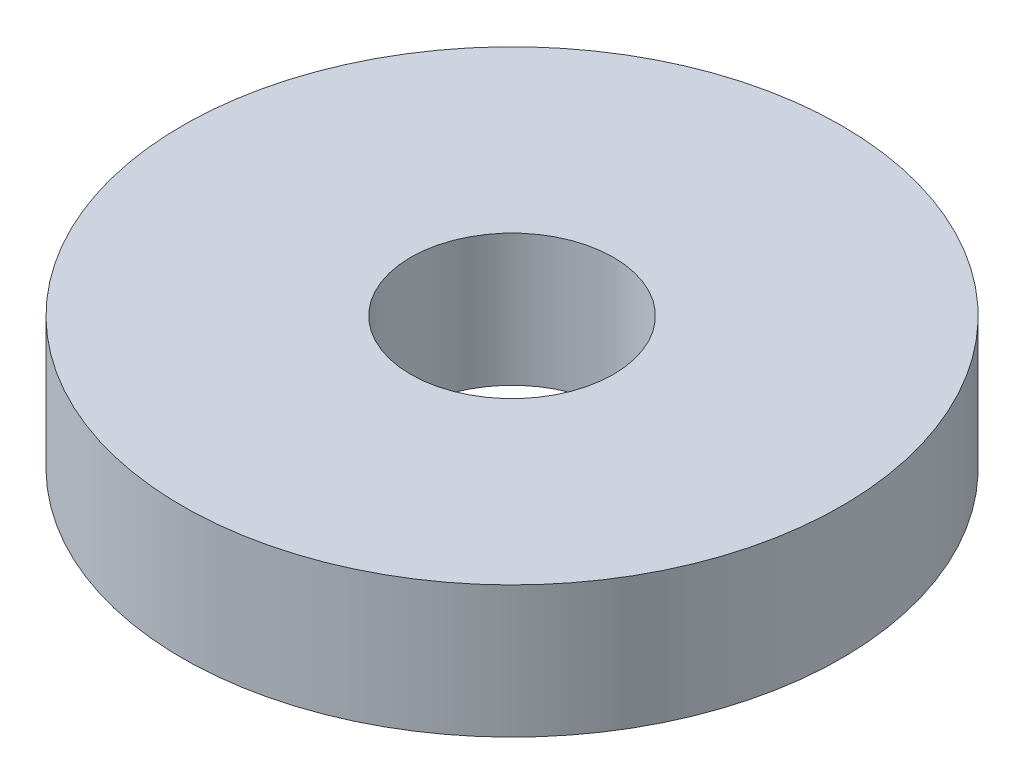
ISO-10303-21;
HEADER;
FILE_DESCRIPTION(('STEP AP214'),'2;1');
FILE_NAME('part.step','',(''),(''),'','','');
FILE_SCHEMA(('AUTOMOTIVE_DESIGN { 1 0 10303 214 1 1 1 1 }'));
ENDSEC;
DATA;
#1=APPLICATION_CONTEXT('core data for automotive mechanical design processes');
#2=APPLICATION_PROTOCOL_DEFINITION('international standard','automotive_design',2000,#1);
#3=PRODUCT_CONTEXT('',#1,'mechanical');
#4=PRODUCT('Part','Part','',(#3));
#5=PRODUCT_RELATED_PRODUCT_CATEGORY('part','',(#4));
#6=PRODUCT_DEFINITION_FORMATION('','',#4);
#7=PRODUCT_DEFINITION_CONTEXT('part definition',#1,'design');
#8=PRODUCT_DEFINITION('design','',#6,#7);
#9=PRODUCT_DEFINITION_SHAPE('','',#8);
#10=(LENGTH_UNIT() NAMED_UNIT(*) SI_UNIT(.MILLI.,.METRE.));
#11=(NAMED_UNIT(*) PLANE_ANGLE_UNIT() SI_UNIT($,.RADIAN.));
#12=(NAMED_UNIT(*) SI_UNIT($,.STERADIAN.) SOLID_ANGLE_UNIT());
#13=UNCERTAINTY_MEASURE_WITH_UNIT(LENGTH_MEASURE(1.E-05),#10,'distance_accuracy_value','');
#14=(GEOMETRIC_REPRESENTATION_CONTEXT(3) GLOBAL_UNCERTAINTY_ASSIGNED_CONTEXT((#13)) GLOBAL_UNIT_ASSIGNED_CONTEXT((#10,
#11,#12)) REPRESENTATION_CONTEXT('',''));
#15=CARTESIAN_POINT('',(0.,0.,0.));
#16=DIRECTION('',(0.,0.,1.));
#17=DIRECTION('',(1.,0.,0.));
#18=AXIS2_PLACEMENT_3D('',#15,#16,#17);
#19=CARTESIAN_POINT('',(0.,26.,0.));
#20=DIRECTION('',(0.,-1.,0.));
#21=DIRECTION('',(0.,0.,-1.));
#22=AXIS2_PLACEMENT_3D('',#19,#20,#21);
#23=CYLINDRICAL_SURFACE('',#22,65.);
#24=CARTESIAN_POINT('',(0.,26.,0.));
#25=DIRECTION('',(0.,1.,0.));
#26=DIRECTION('',(0.,0.,1.));
#27=AXIS2_PLACEMENT_3D('',#24,#25,#26);
#28=CIRCLE('',#27,65.);
#29=CARTESIAN_POINT('',(0.,26.,-65.));
#30=VERTEX_POINT('',#29);
#31=EDGE_CURVE('E10',#30,#30,#28,.T.);
#32=CARTESIAN_POINT('',(0.,0.,0.));
#33=DIRECTION('',(0.,1.,0.));
#34=DIRECTION('',(0.,0.,1.));
#35=AXIS2_PLACEMENT_3D('',#32,#33,#34);
#36=CIRCLE('',#35,65.);
#37=CARTESIAN_POINT('',(0.,0.,-65.));
#38=VERTEX_POINT('',#37);
#39=EDGE_CURVE('E37',#38,#38,#36,.T.);
#40=CARTESIAN_POINT('',(0.,26.,-65.));
#41=CARTESIAN_POINT('',(0.,25.7291666666667,-65.));
#42=CARTESIAN_POINT('',(0.,25.4583333333333,-65.));
#43=CARTESIAN_POINT('',(0.,24.9166666666667,-65.));
#44=CARTESIAN_POINT('',(0.,24.6458333333333,-65.));
#45=CARTESIAN_POINT('',(0.,24.1041666666667,-65.));
#46=CARTESIAN_POINT('',(0.,23.8333333333333,-65.));
#47=CARTESIAN_POINT('',(0.,23.2916666666667,-65.));
#48=CARTESIAN_POINT('',(0.,23.0208333333333,-65.));
#49=CARTESIAN_POINT('',(0.,22.4791666666667,-65.));
#50=CARTESIAN_POINT('',(0.,22.2083333333333,-65.));
#51=CARTESIAN_POINT('',(0.,21.6666666666667,-65.));
#52=CARTESIAN_POINT('',(0.,21.3958333333333,-65.));
#53=CARTESIAN_POINT('',(0.,20.8541666666667,-65.));
#54=CARTESIAN_POINT('',(0.,20.5833333333333,-65.));
#55=CARTESIAN_POINT('',(0.,20.0416666666667,-65.));
#56=CARTESIAN_POINT('',(0.,19.7708333333333,-65.));
#57=CARTESIAN_POINT('',(0.,19.2291666666667,-65.));
#58=CARTESIAN_POINT('',(0.,18.9583333333333,-65.));
#59=CARTESIAN_POINT('',(0.,18.4166666666667,-65.));
#60=CARTESIAN_POINT('',(0.,18.1458333333333,-65.));
#61=CARTESIAN_POINT('',(0.,17.6041666666667,-65.));
#62=CARTESIAN_POINT('',(0.,17.3333333333333,-65.));
#63=CARTESIAN_POINT('',(0.,16.7916666666667,-65.));
#64=CARTESIAN_POINT('',(0.,16.5208333333333,-65.));
#65=CARTESIAN_POINT('',(0.,15.9791666666667,-65.));
#66=CARTESIAN_POINT('',(0.,15.7083333333333,-65.));
#67=CARTESIAN_POINT('',(0.,15.1666666666667,-65.));
#68=CARTESIAN_POINT('',(0.,14.8958333333333,-65.));
#69=CARTESIAN_POINT('',(0.,14.3541666666667,-65.));
#70=CARTESIAN_POINT('',(0.,14.0833333333333,-65.));
#71=CARTESIAN_POINT('',(0.,13.5416666666667,-65.));
#72=CARTESIAN_POINT('',(0.,13.2708333333333,-65.));
#73=CARTESIAN_POINT('',(0.,12.7291666666667,-65.));
#74=CARTESIAN_POINT('',(0.,12.4583333333333,-65.));
#75=CARTESIAN_POINT('',(0.,11.9166666666667,-65.));
#76=CARTESIAN_POINT('',(0.,11.6458333333333,-65.));
#77=CARTESIAN_POINT('',(0.,11.1041666666667,-65.));
#78=CARTESIAN_POINT('',(0.,10.8333333333333,-65.));
#79=CARTESIAN_POINT('',(0.,10.2916666666667,-65.));
#80=CARTESIAN_POINT('',(0.,10.0208333333333,-65.));
#81=CARTESIAN_POINT('',(0.,9.47916666666667,-65.));
#82=CARTESIAN_POINT('',(0.,9.20833333333333,-65.));
#83=CARTESIAN_POINT('',(0.,8.66666666666667,-65.));
#84=CARTESIAN_POINT('',(0.,8.39583333333333,-65.));
#85=CARTESIAN_POINT('',(0.,7.85416666666667,-65.));
#86=CARTESIAN_POINT('',(0.,7.58333333333333,-65.));
#87=CARTESIAN_POINT('',(0.,7.04166666666667,-65.));
#88=CARTESIAN_POINT('',(0.,6.77083333333333,-65.));
#89=CARTESIAN_POINT('',(0.,6.22916666666667,-65.));
#90=CARTESIAN_POINT('',(0.,5.95833333333333,-65.));
#91=CARTESIAN_POINT('',(0.,5.41666666666667,-65.));
#92=CARTESIAN_POINT('',(0.,5.14583333333333,-65.));
#93=CARTESIAN_POINT('',(0.,4.60416666666667,-65.));
#94=CARTESIAN_POINT('',(0.,4.33333333333333,-65.));
#95=CARTESIAN_POINT('',(0.,3.79166666666667,-65.));
#96=CARTESIAN_POINT('',(0.,3.52083333333333,-65.));
#97=CARTESIAN_POINT('',(0.,2.97916666666667,-65.));
#98=CARTESIAN_POINT('',(0.,2.70833333333333,-65.));
#99=CARTESIAN_POINT('',(0.,2.16666666666667,-65.));
#100=CARTESIAN_POINT('',(0.,1.89583333333333,-65.));
#101=CARTESIAN_POINT('',(0.,1.35416666666667,-65.));
#102=CARTESIAN_POINT('',(0.,1.08333333333333,-65.));
#103=CARTESIAN_POINT('',(0.,0.541666666666667,-65.));
#104=CARTESIAN_POINT('',(0.,0.270833333333334,-65.));
#105=CARTESIAN_POINT('',(0.,0.,-65.));
#106=B_SPLINE_CURVE_WITH_KNOTS('',3,(#40,#41,#42,#43,#44,#45,#46,#47,#48,#49,#50,#51,#52,#53,
#54,#55,#56,#57,#58,#59,#60,#61,#62,#63,#64,#65,#66,#67,#68,#69,#70,#71,#72,#73,#74,#75,#76,#77,
#78,#79,#80,#81,#82,#83,#84,#85,#86,#87,#88,#89,#90,#91,#92,#93,#94,#95,#96,#97,#98,#99,#100,
#101,#102,#103,#104,#105),.UNSPECIFIED.,.F.,.F.,(4,2,2,2,2,2,2,2,2,2,2,2,2,2,2,2,2,2,2,2,2,2,2,
2,2,2,2,2,2,2,2,2,4),(0.,0.812499999999997,1.625,2.4375,3.25,4.0625,4.875,5.6875,6.5,7.3125,
8.125,8.93749999999999,9.74999999999999,10.5625,11.375,12.1875,13.,13.8125,14.625,15.4375,16.25,
17.0625,17.875,18.6875,19.5,20.3125,21.125,21.9375,22.75,23.5625,24.375,25.1875,26.),.UNSPECIFIED.);
#107=EDGE_CURVE('BSEAM40',#30,#38,#106,.T.);
#108=ORIENTED_EDGE('',*,*,#31,.F.);
#109=ORIENTED_EDGE('',*,*,#39,.T.);
#110=ORIENTED_EDGE('',*,*,#107,.T.);
#111=ORIENTED_EDGE('',*,*,#107,.F.);
#112=EDGE_LOOP('',(#108,#110,#109,#111));
#113=FACE_BOUND('',#112,.T.);
#114=ADVANCED_FACE('F40',(#113),#23,.T.);
#115=CARTESIAN_POINT('',(0.,26.,0.));
#116=DIRECTION('',(0.,1.,0.));
#117=DIRECTION('',(0.,0.,1.));
#118=AXIS2_PLACEMENT_3D('',#115,#116,#117);
#119=PLANE('',#118);
#120=CARTESIAN_POINT('',(0.,26.,0.));
#121=DIRECTION('',(0.,1.,0.));
#122=DIRECTION('',(0.,0.,1.));
#123=AXIS2_PLACEMENT_3D('',#120,#121,#122);
#124=CIRCLE('',#123,20.);
#125=CARTESIAN_POINT('',(0.,26.,-20.));
#126=VERTEX_POINT('',#125);
#127=EDGE_CURVE('E50',#126,#126,#124,.T.);
#128=ORIENTED_EDGE('',*,*,#127,.F.);
#129=EDGE_LOOP('',(#128));
#130=FACE_BOUND('',#129,.T.);
#131=ORIENTED_EDGE('',*,*,#31,.T.);
#132=EDGE_LOOP('',(#131));
#133=FACE_BOUND('',#132,.T.);
#134=ADVANCED_FACE('F59',(#130,#133),#119,.T.);
#135=CARTESIAN_POINT('',(0.,0.,0.));
#136=DIRECTION('',(0.,1.,0.));
#137=DIRECTION('',(0.,0.,1.));
#138=AXIS2_PLACEMENT_3D('',#135,#136,#137);
#139=PLANE('',#138);
#140=CARTESIAN_POINT('',(0.,0.,0.));
#141=DIRECTION('',(0.,1.,0.));
#142=DIRECTION('',(0.,0.,1.));
#143=AXIS2_PLACEMENT_3D('',#140,#141,#142);
#144=CIRCLE('',#143,20.);
#145=CARTESIAN_POINT('',(0.,0.,-20.));
#146=VERTEX_POINT('',#145);
#147=EDGE_CURVE('E47',#146,#146,#144,.T.);
#148=ORIENTED_EDGE('',*,*,#147,.T.);
#149=EDGE_LOOP('',(#148));
#150=FACE_BOUND('',#149,.T.);
#151=ORIENTED_EDGE('',*,*,#39,.F.);
#152=EDGE_LOOP('',(#151));
#153=FACE_BOUND('',#152,.T.);
#154=ADVANCED_FACE('F58',(#150,#153),#139,.F.);
#155=CARTESIAN_POINT('',(0.,26.,0.));
#156=DIRECTION('',(0.,-1.,0.));
#157=DIRECTION('',(0.,0.,-1.));
#158=AXIS2_PLACEMENT_3D('',#155,#156,#157);
#159=CYLINDRICAL_SURFACE('',#158,20.);
#160=CARTESIAN_POINT('',(0.,26.,-20.));
#161=CARTESIAN_POINT('',(0.,25.7291666666667,-20.));
#162=CARTESIAN_POINT('',(0.,25.4583333333333,-20.));
#163=CARTESIAN_POINT('',(0.,24.9166666666667,-20.));
#164=CARTESIAN_POINT('',(0.,24.6458333333333,-20.));
#165=CARTESIAN_POINT('',(0.,24.1041666666667,-20.));
#166=CARTESIAN_POINT('',(0.,23.8333333333333,-20.));
#167=CARTESIAN_POINT('',(0.,23.2916666666667,-20.));
#168=CARTESIAN_POINT('',(0.,23.0208333333333,-20.));
#169=CARTESIAN_POINT('',(0.,22.4791666666667,-20.));
#170=CARTESIAN_POINT('',(0.,22.2083333333333,-20.));
#171=CARTESIAN_POINT('',(0.,21.6666666666667,-20.));
#172=CARTESIAN_POINT('',(0.,21.3958333333333,-20.));
#173=CARTESIAN_POINT('',(0.,20.8541666666667,-20.));
#174=CARTESIAN_POINT('',(0.,20.5833333333333,-20.));
#175=CARTESIAN_POINT('',(0.,20.0416666666667,-20.));
#176=CARTESIAN_POINT('',(0.,19.7708333333333,-20.));
#177=CARTESIAN_POINT('',(0.,19.2291666666667,-20.));
#178=CARTESIAN_POINT('',(0.,18.9583333333333,-20.));
#179=CARTESIAN_POINT('',(0.,18.4166666666667,-20.));
#180=CARTESIAN_POINT('',(0.,18.1458333333333,-20.));
#181=CARTESIAN_POINT('',(0.,17.6041666666667,-20.));
#182=CARTESIAN_POINT('',(0.,17.3333333333333,-20.));
#183=CARTESIAN_POINT('',(0.,16.7916666666667,-20.));
#184=CARTESIAN_POINT('',(0.,16.5208333333333,-20.));
#185=CARTESIAN_POINT('',(0.,15.9791666666667,-20.));
#186=CARTESIAN_POINT('',(0.,15.7083333333333,-20.));
#187=CARTESIAN_POINT('',(0.,15.1666666666667,-20.));
#188=CARTESIAN_POINT('',(0.,14.8958333333333,-20.));
#189=CARTESIAN_POINT('',(0.,14.3541666666667,-20.));
#190=CARTESIAN_POINT('',(0.,14.0833333333333,-20.));
#191=CARTESIAN_POINT('',(0.,13.5416666666667,-20.));
#192=CARTESIAN_POINT('',(0.,13.2708333333333,-20.));
#193=CARTESIAN_POINT('',(0.,12.7291666666667,-20.));
#194=CARTESIAN_POINT('',(0.,12.4583333333333,-20.));
#195=CARTESIAN_POINT('',(0.,11.9166666666667,-20.));
#196=CARTESIAN_POINT('',(0.,11.6458333333333,-20.));
#197=CARTESIAN_POINT('',(0.,11.1041666666667,-20.));
#198=CARTESIAN_POINT('',(0.,10.8333333333333,-20.));
#199=CARTESIAN_POINT('',(0.,10.2916666666667,-20.));
#200=CARTESIAN_POINT('',(0.,10.0208333333333,-20.));
#201=CARTESIAN_POINT('',(0.,9.47916666666667,-20.));
#202=CARTESIAN_POINT('',(0.,9.20833333333333,-20.));
#203=CARTESIAN_POINT('',(0.,8.66666666666667,-20.));
#204=CARTESIAN_POINT('',(0.,8.39583333333333,-20.));
#205=CARTESIAN_POINT('',(0.,7.85416666666667,-20.));
#206=CARTESIAN_POINT('',(0.,7.58333333333333,-20.));
#207=CARTESIAN_POINT('',(0.,7.04166666666667,-20.));
#208=CARTESIAN_POINT('',(0.,6.77083333333333,-20.));
#209=CARTESIAN_POINT('',(0.,6.22916666666667,-20.));
#210=CARTESIAN_POINT('',(0.,5.95833333333333,-20.));
#211=CARTESIAN_POINT('',(0.,5.41666666666667,-20.));
#212=CARTESIAN_POINT('',(0.,5.14583333333333,-20.));
#213=CARTESIAN_POINT('',(0.,4.60416666666667,-20.));
#214=CARTESIAN_POINT('',(0.,4.33333333333333,-20.));
#215=CARTESIAN_POINT('',(0.,3.79166666666667,-20.));
#216=CARTESIAN_POINT('',(0.,3.52083333333333,-20.));
#217=CARTESIAN_POINT('',(0.,2.97916666666667,-20.));
#218=CARTESIAN_POINT('',(0.,2.70833333333333,-20.));
#219=CARTESIAN_POINT('',(0.,2.16666666666667,-20.));
#220=CARTESIAN_POINT('',(0.,1.89583333333333,-20.));
#221=CARTESIAN_POINT('',(0.,1.35416666666667,-20.));
#222=CARTESIAN_POINT('',(0.,1.08333333333333,-20.));
#223=CARTESIAN_POINT('',(0.,0.541666666666667,-20.));
#224=CARTESIAN_POINT('',(0.,0.270833333333334,-20.));
#225=CARTESIAN_POINT('',(0.,0.,-20.));
#226=B_SPLINE_CURVE_WITH_KNOTS('',3,(#160,#161,#162,#163,#164,#165,#166,#167,#168,#169,#170,
#171,#172,#173,#174,#175,#176,#177,#178,#179,#180,#181,#182,#183,#184,#185,#186,#187,#188,#189,
#190,#191,#192,#193,#194,#195,#196,#197,#198,#199,#200,#201,#202,#203,#204,#205,#206,#207,#208,
#209,#210,#211,#212,#213,#214,#215,#216,#217,#218,#219,#220,#221,#222,#223,#224,#225),
.UNSPECIFIED.,.F.,.F.,(4,2,2,2,2,2,2,2,2,2,2,2,2,2,2,2,2,2,2,2,2,2,2,2,2,2,2,2,2,2,2,2,4),(0.,
0.812500000000001,1.625,2.4375,3.25,4.0625,4.875,5.6875,6.5,7.3125,8.125,8.9375,9.75,10.5625,
11.375,12.1875,13.,13.8125,14.625,15.4375,16.25,17.0625,17.875,18.6875,19.5,20.3125,21.125,
21.9375,22.75,23.5625,24.375,25.1875,26.),.UNSPECIFIED.);
#227=EDGE_CURVE('BSEAM54',#126,#146,#226,.T.);
#228=ORIENTED_EDGE('',*,*,#127,.T.);
#229=ORIENTED_EDGE('',*,*,#147,.F.);
#230=ORIENTED_EDGE('',*,*,#227,.T.);
#231=ORIENTED_EDGE('',*,*,#227,.F.);
#232=EDGE_LOOP('',(#228,#230,#229,#231));
#233=FACE_BOUND('',#232,.T.);
#234=ADVANCED_FACE('F54',(#233),#159,.F.);
#235=CLOSED_SHELL('',(#114,#134,#154,#234));
#236=MANIFOLD_SOLID_BREP('B2',#235);
#237=ADVANCED_BREP_SHAPE_REPRESENTATION('',(#18,#236),#14);
#238=SHAPE_DEFINITION_REPRESENTATION(#9,#237);
ENDSEC;
END-ISO-10303-21;
